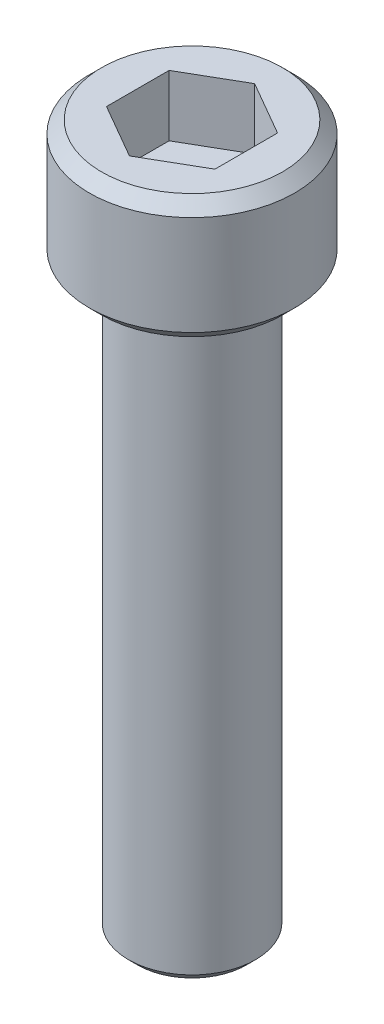
ISO-10303-21;
HEADER;
FILE_DESCRIPTION(('STEP AP214'),'2;1');
FILE_NAME('part.step','',(''),(''),'','','');
FILE_SCHEMA(('AUTOMOTIVE_DESIGN { 1 0 10303 214 1 1 1 1 }'));
ENDSEC;
DATA;
#1=APPLICATION_CONTEXT('core data for automotive mechanical design processes');
#2=APPLICATION_PROTOCOL_DEFINITION('international standard','automotive_design',2000,#1);
#3=PRODUCT_CONTEXT('',#1,'mechanical');
#4=PRODUCT('Part','Part','',(#3));
#5=PRODUCT_RELATED_PRODUCT_CATEGORY('part','',(#4));
#6=PRODUCT_DEFINITION_FORMATION('','',#4);
#7=PRODUCT_DEFINITION_CONTEXT('part definition',#1,'design');
#8=PRODUCT_DEFINITION('design','',#6,#7);
#9=PRODUCT_DEFINITION_SHAPE('','',#8);
#10=(LENGTH_UNIT() NAMED_UNIT(*) SI_UNIT(.MILLI.,.METRE.));
#11=(NAMED_UNIT(*) PLANE_ANGLE_UNIT() SI_UNIT($,.RADIAN.));
#12=(NAMED_UNIT(*) SI_UNIT($,.STERADIAN.) SOLID_ANGLE_UNIT());
#13=UNCERTAINTY_MEASURE_WITH_UNIT(LENGTH_MEASURE(1.E-05),#10,'distance_accuracy_value','');
#14=(GEOMETRIC_REPRESENTATION_CONTEXT(3) GLOBAL_UNCERTAINTY_ASSIGNED_CONTEXT((#13)) GLOBAL_UNIT_ASSIGNED_CONTEXT((#10,
#11,#12)) REPRESENTATION_CONTEXT('',''));
#15=CARTESIAN_POINT('',(0.,0.,0.));
#16=DIRECTION('',(0.,0.,1.));
#17=DIRECTION('',(1.,0.,0.));
#18=AXIS2_PLACEMENT_3D('',#15,#16,#17);
#19=CARTESIAN_POINT('',(1.778,2.064,3.07958633585746));
#20=DIRECTION('',(0.,1.,0.));
#21=DIRECTION('',(0.,0.,1.));
#22=AXIS2_PLACEMENT_3D('',#19,#20,#21);
#23=PLANE('',#22);
#24=DIRECTION('',(-0.866025403784439,0.,0.5));
#25=VECTOR('',#24,1.);
#26=CARTESIAN_POINT('',(0.,2.064,-2.05305755723831));
#27=LINE('',#26,#25);
#28=CARTESIAN_POINT('',(0.,2.064,-2.05305755723831));
#29=VERTEX_POINT('',#28);
#30=CARTESIAN_POINT('',(-1.778,2.064,-1.02652877861915));
#31=VERTEX_POINT('',#30);
#32=EDGE_CURVE('E68',#29,#31,#27,.T.);
#33=ORIENTED_EDGE('',*,*,#32,.T.);
#34=DIRECTION('',(0.,0.,1.));
#35=VECTOR('',#34,1.);
#36=CARTESIAN_POINT('',(-1.778,2.064,-1.02652877861915));
#37=LINE('',#36,#35);
#38=CARTESIAN_POINT('',(-1.778,2.064,1.02652877861916));
#39=VERTEX_POINT('',#38);
#40=EDGE_CURVE('E70',#31,#39,#37,.T.);
#41=ORIENTED_EDGE('',*,*,#40,.T.);
#42=DIRECTION('',(0.866025403784439,0.,0.499999999999999));
#43=VECTOR('',#42,1.);
#44=CARTESIAN_POINT('',(-1.778,2.064,1.02652877861916));
#45=LINE('',#44,#43);
#46=CARTESIAN_POINT('',(0.,2.064,2.05305755723831));
#47=VERTEX_POINT('',#46);
#48=EDGE_CURVE('E72',#39,#47,#45,.T.);
#49=ORIENTED_EDGE('',*,*,#48,.T.);
#50=DIRECTION('',(0.866025403784438,0.,-0.500000000000001));
#51=VECTOR('',#50,1.);
#52=CARTESIAN_POINT('',(0.,2.064,2.05305755723831));
#53=LINE('',#52,#51);
#54=CARTESIAN_POINT('',(1.778,2.064,1.02652877861915));
#55=VERTEX_POINT('',#54);
#56=EDGE_CURVE('E127',#47,#55,#53,.T.);
#57=ORIENTED_EDGE('',*,*,#56,.T.);
#58=DIRECTION('',(0.,0.,-1.));
#59=VECTOR('',#58,1.);
#60=CARTESIAN_POINT('',(1.778,2.064,1.02652877861915));
#61=LINE('',#60,#59);
#62=CARTESIAN_POINT('',(1.778,2.064,-1.02652877861916));
#63=VERTEX_POINT('',#62);
#64=EDGE_CURVE('E132',#55,#63,#61,.T.);
#65=ORIENTED_EDGE('',*,*,#64,.T.);
#66=DIRECTION('',(-0.866025403784439,0.,-0.499999999999999));
#67=VECTOR('',#66,1.);
#68=CARTESIAN_POINT('',(1.778,2.064,-1.02652877861916));
#69=LINE('',#68,#67);
#70=EDGE_CURVE('E136',#63,#29,#69,.T.);
#71=ORIENTED_EDGE('',*,*,#70,.T.);
#72=EDGE_LOOP('',(#33,#41,#49,#57,#65,#71));
#73=FACE_BOUND('',#72,.T.);
#74=ADVANCED_FACE('F17',(#73),#23,.T.);
#75=CARTESIAN_POINT('',(-1.778,2.064,1.02652877861916));
#76=DIRECTION('',(-0.499999999999999,0.,0.866025403784439));
#77=DIRECTION('',(0.866025403784439,0.,0.499999999999999));
#78=AXIS2_PLACEMENT_3D('',#75,#76,#77);
#79=PLANE('',#78);
#80=DIRECTION('',(0.,1.,0.));
#81=VECTOR('',#80,1.);
#82=CARTESIAN_POINT('',(0.,2.064,2.05305755723831));
#83=LINE('',#82,#81);
#84=CARTESIAN_POINT('',(0.,4.064,2.05305755723831));
#85=VERTEX_POINT('',#84);
#86=EDGE_CURVE('E83',#85,#47,#83,.F.);
#87=ORIENTED_EDGE('',*,*,#86,.T.);
#88=ORIENTED_EDGE('',*,*,#48,.F.);
#89=DIRECTION('',(0.,1.,0.));
#90=VECTOR('',#89,1.);
#91=CARTESIAN_POINT('',(-1.778,2.064,1.02652877861916));
#92=LINE('',#91,#90);
#93=CARTESIAN_POINT('',(-1.778,4.064,1.02652877861916));
#94=VERTEX_POINT('',#93);
#95=EDGE_CURVE('E77',#39,#94,#92,.T.);
#96=ORIENTED_EDGE('',*,*,#95,.T.);
#97=DIRECTION('',(-0.866025403784439,0.,-0.5));
#98=VECTOR('',#97,1.);
#99=CARTESIAN_POINT('',(0.,4.064,2.05305755723831));
#100=LINE('',#99,#98);
#101=EDGE_CURVE('E124',#85,#94,#100,.T.);
#102=ORIENTED_EDGE('',*,*,#101,.F.);
#103=EDGE_LOOP('',(#87,#88,#96,#102));
#104=FACE_BOUND('',#103,.T.);
#105=ADVANCED_FACE('F80',(#104),#79,.F.);
#106=CARTESIAN_POINT('',(-1.778,2.064,-1.02652877861915));
#107=DIRECTION('',(-1.,0.,0.));
#108=DIRECTION('',(0.,0.,1.));
#109=AXIS2_PLACEMENT_3D('',#106,#107,#108);
#110=PLANE('',#109);
#111=ORIENTED_EDGE('',*,*,#95,.F.);
#112=ORIENTED_EDGE('',*,*,#40,.F.);
#113=DIRECTION('',(0.,1.,0.));
#114=VECTOR('',#113,1.);
#115=CARTESIAN_POINT('',(-1.778,2.064,-1.02652877861915));
#116=LINE('',#115,#114);
#117=CARTESIAN_POINT('',(-1.778,4.064,-1.02652877861915));
#118=VERTEX_POINT('',#117);
#119=EDGE_CURVE('E91',#31,#118,#116,.T.);
#120=ORIENTED_EDGE('',*,*,#119,.T.);
#121=DIRECTION('',(0.,0.,1.));
#122=VECTOR('',#121,1.);
#123=CARTESIAN_POINT('',(-1.778,4.064,0.));
#124=LINE('',#123,#122);
#125=EDGE_CURVE('E88',#94,#118,#124,.F.);
#126=ORIENTED_EDGE('',*,*,#125,.F.);
#127=EDGE_LOOP('',(#111,#112,#120,#126));
#128=FACE_BOUND('',#127,.T.);
#129=ADVANCED_FACE('F86',(#128),#110,.F.);
#130=CARTESIAN_POINT('',(0.,2.064,-2.05305755723831));
#131=DIRECTION('',(-0.5,0.,-0.866025403784439));
#132=DIRECTION('',(-0.866025403784439,0.,0.5));
#133=AXIS2_PLACEMENT_3D('',#130,#131,#132);
#134=PLANE('',#133);
#135=ORIENTED_EDGE('',*,*,#119,.F.);
#136=ORIENTED_EDGE('',*,*,#32,.F.);
#137=DIRECTION('',(0.,1.,0.));
#138=VECTOR('',#137,1.);
#139=CARTESIAN_POINT('',(0.,2.064,-2.05305755723831));
#140=LINE('',#139,#138);
#141=CARTESIAN_POINT('',(0.,4.064,-2.05305755723831));
#142=VERTEX_POINT('',#141);
#143=EDGE_CURVE('E134',#29,#142,#140,.T.);
#144=ORIENTED_EDGE('',*,*,#143,.T.);
#145=DIRECTION('',(0.866025403784438,0.,-0.5));
#146=VECTOR('',#145,1.);
#147=CARTESIAN_POINT('',(-1.778,4.064,-1.02652877861915));
#148=LINE('',#147,#146);
#149=EDGE_CURVE('E120',#118,#142,#148,.T.);
#150=ORIENTED_EDGE('',*,*,#149,.F.);
#151=EDGE_LOOP('',(#135,#136,#144,#150));
#152=FACE_BOUND('',#151,.T.);
#153=ADVANCED_FACE('F139',(#152),#134,.F.);
#154=CARTESIAN_POINT('',(1.778,2.064,-1.02652877861916));
#155=DIRECTION('',(0.499999999999999,0.,-0.866025403784439));
#156=DIRECTION('',(-0.866025403784439,0.,-0.499999999999999));
#157=AXIS2_PLACEMENT_3D('',#154,#155,#156);
#158=PLANE('',#157);
#159=ORIENTED_EDGE('',*,*,#143,.F.);
#160=ORIENTED_EDGE('',*,*,#70,.F.);
#161=DIRECTION('',(0.,1.,0.));
#162=VECTOR('',#161,1.);
#163=CARTESIAN_POINT('',(1.778,2.064,-1.02652877861916));
#164=LINE('',#163,#162);
#165=CARTESIAN_POINT('',(1.778,4.064,-1.02652877861916));
#166=VERTEX_POINT('',#165);
#167=EDGE_CURVE('E130',#63,#166,#164,.T.);
#168=ORIENTED_EDGE('',*,*,#167,.T.);
#169=DIRECTION('',(0.866025403784439,0.,0.5));
#170=VECTOR('',#169,1.);
#171=CARTESIAN_POINT('',(0.,4.064,-2.05305755723831));
#172=LINE('',#171,#170);
#173=EDGE_CURVE('E117',#142,#166,#172,.T.);
#174=ORIENTED_EDGE('',*,*,#173,.F.);
#175=EDGE_LOOP('',(#159,#160,#168,#174));
#176=FACE_BOUND('',#175,.T.);
#177=ADVANCED_FACE('F151',(#176),#158,.F.);
#178=CARTESIAN_POINT('',(1.778,2.064,1.02652877861915));
#179=DIRECTION('',(1.,0.,0.));
#180=DIRECTION('',(0.,0.,-1.));
#181=AXIS2_PLACEMENT_3D('',#178,#179,#180);
#182=PLANE('',#181);
#183=ORIENTED_EDGE('',*,*,#167,.F.);
#184=ORIENTED_EDGE('',*,*,#64,.F.);
#185=DIRECTION('',(0.,1.,0.));
#186=VECTOR('',#185,1.);
#187=CARTESIAN_POINT('',(1.778,2.064,1.02652877861915));
#188=LINE('',#187,#186);
#189=CARTESIAN_POINT('',(1.778,4.064,1.02652877861915));
#190=VERTEX_POINT('',#189);
#191=EDGE_CURVE('E35',#55,#190,#188,.T.);
#192=ORIENTED_EDGE('',*,*,#191,.T.);
#193=DIRECTION('',(0.,0.,1.));
#194=VECTOR('',#193,1.);
#195=CARTESIAN_POINT('',(1.778,4.064,0.));
#196=LINE('',#195,#194);
#197=EDGE_CURVE('E114',#166,#190,#196,.T.);
#198=ORIENTED_EDGE('',*,*,#197,.F.);
#199=EDGE_LOOP('',(#183,#184,#192,#198));
#200=FACE_BOUND('',#199,.T.);
#201=ADVANCED_FACE('F149',(#200),#182,.F.);
#202=CARTESIAN_POINT('',(0.,2.064,2.05305755723831));
#203=DIRECTION('',(0.500000000000001,0.,0.866025403784438));
#204=DIRECTION('',(0.866025403784438,0.,-0.500000000000001));
#205=AXIS2_PLACEMENT_3D('',#202,#203,#204);
#206=PLANE('',#205);
#207=ORIENTED_EDGE('',*,*,#191,.F.);
#208=ORIENTED_EDGE('',*,*,#56,.F.);
#209=ORIENTED_EDGE('',*,*,#86,.F.);
#210=DIRECTION('',(-0.866025403784438,0.,0.500000000000001));
#211=VECTOR('',#210,1.);
#212=CARTESIAN_POINT('',(1.778,4.064,1.02652877861915));
#213=LINE('',#212,#211);
#214=EDGE_CURVE('E111',#190,#85,#213,.T.);
#215=ORIENTED_EDGE('',*,*,#214,.F.);
#216=EDGE_LOOP('',(#207,#208,#209,#215));
#217=FACE_BOUND('',#216,.T.);
#218=ADVANCED_FACE('F146',(#217),#206,.F.);
#219=CARTESIAN_POINT('',(0.,4.064,0.));
#220=DIRECTION('',(0.,1.,0.));
#221=DIRECTION('',(0.,0.,1.));
#222=AXIS2_PLACEMENT_3D('',#219,#220,#221);
#223=PLANE('',#222);
#224=ORIENTED_EDGE('',*,*,#197,.T.);
#225=ORIENTED_EDGE('',*,*,#214,.T.);
#226=ORIENTED_EDGE('',*,*,#101,.T.);
#227=ORIENTED_EDGE('',*,*,#125,.T.);
#228=ORIENTED_EDGE('',*,*,#149,.T.);
#229=ORIENTED_EDGE('',*,*,#173,.T.);
#230=EDGE_LOOP('',(#224,#225,#226,#227,#228,#229));
#231=FACE_BOUND('',#230,.T.);
#232=CARTESIAN_POINT('',(0.,4.06400000002805,0.));
#233=DIRECTION('',(0.,-1.,0.));
#234=DIRECTION('',(1.,0.,0.));
#235=AXIS2_PLACEMENT_3D('',#232,#233,#234);
#236=CIRCLE('',#235,2.96550000007301);
#237=CARTESIAN_POINT('',(2.96550000007301,4.06400000002805,0.));
#238=VERTEX_POINT('',#237);
#239=EDGE_CURVE('E20',#238,#238,#236,.T.);
#240=ORIENTED_EDGE('',*,*,#239,.F.);
#241=EDGE_LOOP('',(#240));
#242=FACE_BOUND('',#241,.T.);
#243=ADVANCED_FACE('F143',(#231,#242),#223,.T.);
#244=CARTESIAN_POINT('',(0.,3.66400000007161,0.));
#245=DIRECTION('',(0.,-1.,0.));
#246=DIRECTION('',(1.,0.,0.));
#247=AXIS2_PLACEMENT_3D('',#244,#245,#246);
#248=CONICAL_SURFACE('',#247,3.36550000002944,0.785398163397448);
#249=ORIENTED_EDGE('',*,*,#239,.T.);
#250=EDGE_LOOP('',(#249));
#251=FACE_BOUND('',#250,.T.);
#252=CARTESIAN_POINT('',(0.,3.664,0.));
#253=DIRECTION('',(0.,-1.,0.));
#254=DIRECTION('',(0.,0.,-1.));
#255=AXIS2_PLACEMENT_3D('',#252,#253,#254);
#256=CIRCLE('',#255,3.3655);
#257=CARTESIAN_POINT('',(0.,3.664,-3.3655));
#258=VERTEX_POINT('',#257);
#259=EDGE_CURVE('E103',#258,#258,#256,.T.);
#260=ORIENTED_EDGE('',*,*,#259,.F.);
#261=EDGE_LOOP('',(#260));
#262=FACE_BOUND('',#261,.T.);
#263=ADVANCED_FACE('F188',(#251,#262),#248,.T.);
#264=CARTESIAN_POINT('',(0.,4.064,0.));
#265=DIRECTION('',(0.,-1.,0.));
#266=DIRECTION('',(0.,0.,-1.));
#267=AXIS2_PLACEMENT_3D('',#264,#265,#266);
#268=CYLINDRICAL_SURFACE('',#267,3.3655);
#269=ORIENTED_EDGE('',*,*,#259,.T.);
#270=EDGE_LOOP('',(#269));
#271=FACE_BOUND('',#270,.T.);
#272=CARTESIAN_POINT('',(0.,0.400000000013279,0.));
#273=DIRECTION('',(0.,1.,0.));
#274=DIRECTION('',(0.,0.,1.));
#275=AXIS2_PLACEMENT_3D('',#272,#273,#274);
#276=CIRCLE('',#275,3.36549999991576);
#277=CARTESIAN_POINT('',(0.,0.400000000013279,3.36549999991576));
#278=VERTEX_POINT('',#277);
#279=EDGE_CURVE('E99',#278,#278,#276,.F.);
#280=ORIENTED_EDGE('',*,*,#279,.F.);
#281=EDGE_LOOP('',(#280));
#282=FACE_BOUND('',#281,.T.);
#283=ADVANCED_FACE('F184',(#271,#282),#268,.T.);
#284=CARTESIAN_POINT('',(0.,-19.05,0.));
#285=DIRECTION('',(0.,1.,0.));
#286=DIRECTION('',(0.,0.,1.));
#287=AXIS2_PLACEMENT_3D('',#284,#285,#286);
#288=PLANE('',#287);
#289=CARTESIAN_POINT('',(0.,-19.0499999999929,0.));
#290=DIRECTION('',(0.,1.,0.));
#291=DIRECTION('',(0.,0.,1.));
#292=AXIS2_PLACEMENT_3D('',#289,#290,#291);
#293=CIRCLE('',#292,1.78279999994402);
#294=CARTESIAN_POINT('',(0.,-19.0499999999929,1.78279999994402));
#295=VERTEX_POINT('',#294);
#296=EDGE_CURVE('E97',#295,#295,#293,.T.);
#297=ORIENTED_EDGE('',*,*,#296,.F.);
#298=EDGE_LOOP('',(#297));
#299=FACE_BOUND('',#298,.T.);
#300=ADVANCED_FACE('F180',(#299),#288,.F.);
#301=CARTESIAN_POINT('',(0.,0.400000000013279,0.));
#302=DIRECTION('',(0.,1.,0.));
#303=DIRECTION('',(0.,0.,1.));
#304=AXIS2_PLACEMENT_3D('',#301,#302,#303);
#305=CONICAL_SURFACE('',#304,3.36549999991576,0.785398163326394);
#306=CARTESIAN_POINT('',(0.,5.6843418860808E-11,0.));
#307=DIRECTION('',(0.,1.,0.));
#308=DIRECTION('',(0.,0.,1.));
#309=AXIS2_PLACEMENT_3D('',#306,#307,#308);
#310=CIRCLE('',#309,2.96550000001616);
#311=CARTESIAN_POINT('',(0.,5.6843418860808E-11,2.96550000001616));
#312=VERTEX_POINT('',#311);
#313=EDGE_CURVE('E95',#312,#312,#310,.T.);
#314=ORIENTED_EDGE('',*,*,#313,.T.);
#315=EDGE_LOOP('',(#314));
#316=FACE_BOUND('',#315,.T.);
#317=ORIENTED_EDGE('',*,*,#279,.T.);
#318=EDGE_LOOP('',(#317));
#319=FACE_BOUND('',#318,.T.);
#320=ADVANCED_FACE('F176',(#316,#319),#305,.T.);
#321=CARTESIAN_POINT('',(0.,-18.7500000000114,0.));
#322=DIRECTION('',(0.,1.,0.));
#323=DIRECTION('',(0.,0.,1.));
#324=AXIS2_PLACEMENT_3D('',#321,#322,#323);
#325=CONICAL_SURFACE('',#324,2.08279999992556,0.785398163397448);
#326=CARTESIAN_POINT('',(0.,-18.75,0.));
#327=DIRECTION('',(0.,1.,0.));
#328=DIRECTION('',(0.,0.,1.));
#329=AXIS2_PLACEMENT_3D('',#326,#327,#328);
#330=CIRCLE('',#329,2.0828);
#331=CARTESIAN_POINT('',(0.,-18.75,2.0828));
#332=VERTEX_POINT('',#331);
#333=EDGE_CURVE('E26',#332,#332,#330,.T.);
#334=ORIENTED_EDGE('',*,*,#333,.F.);
#335=EDGE_LOOP('',(#334));
#336=FACE_BOUND('',#335,.T.);
#337=ORIENTED_EDGE('',*,*,#296,.T.);
#338=EDGE_LOOP('',(#337));
#339=FACE_BOUND('',#338,.T.);
#340=ADVANCED_FACE('F169',(#336,#339),#325,.T.);
#341=CARTESIAN_POINT('',(0.,0.,0.));
#342=DIRECTION('',(0.,1.,0.));
#343=DIRECTION('',(0.,0.,1.));
#344=AXIS2_PLACEMENT_3D('',#341,#342,#343);
#345=PLANE('',#344);
#346=CARTESIAN_POINT('',(0.,0.,0.));
#347=DIRECTION('',(0.,1.,0.));
#348=DIRECTION('',(0.,0.,1.));
#349=AXIS2_PLACEMENT_3D('',#346,#347,#348);
#350=CIRCLE('',#349,2.0828);
#351=CARTESIAN_POINT('',(0.,0.,2.0828));
#352=VERTEX_POINT('',#351);
#353=EDGE_CURVE('E11',#352,#352,#350,.F.);
#354=ORIENTED_EDGE('',*,*,#353,.F.);
#355=EDGE_LOOP('',(#354));
#356=FACE_BOUND('',#355,.T.);
#357=ORIENTED_EDGE('',*,*,#313,.F.);
#358=EDGE_LOOP('',(#357));
#359=FACE_BOUND('',#358,.T.);
#360=ADVANCED_FACE('F163',(#356,#359),#345,.F.);
#361=CARTESIAN_POINT('',(0.,-19.05,0.));
#362=DIRECTION('',(0.,1.,0.));
#363=DIRECTION('',(0.,0.,1.));
#364=AXIS2_PLACEMENT_3D('',#361,#362,#363);
#365=CYLINDRICAL_SURFACE('',#364,2.0828);
#366=ORIENTED_EDGE('',*,*,#353,.T.);
#367=EDGE_LOOP('',(#366));
#368=FACE_BOUND('',#367,.T.);
#369=ORIENTED_EDGE('',*,*,#333,.T.);
#370=EDGE_LOOP('',(#369));
#371=FACE_BOUND('',#370,.T.);
#372=ADVANCED_FACE('F161',(#368,#371),#365,.T.);
#373=CLOSED_SHELL('',(#74,#105,#129,#153,#177,#201,#218,#243,#263,#283,#300,#320,#340,#360,#372));
#374=MANIFOLD_SOLID_BREP('B1',#373);
#375=ADVANCED_BREP_SHAPE_REPRESENTATION('',(#18,#374),#14);
#376=SHAPE_DEFINITION_REPRESENTATION(#9,#375);
ENDSEC;
END-ISO-10303-21;
